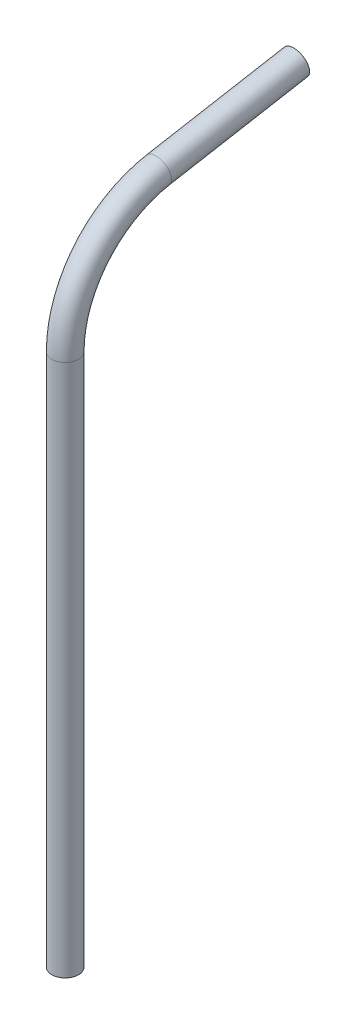
ISO-10303-21;
HEADER;
FILE_DESCRIPTION(('STEP AP214'),'2;1');
FILE_NAME('part.step','',(''),(''),'','','');
FILE_SCHEMA(('AUTOMOTIVE_DESIGN { 1 0 10303 214 1 1 1 1 }'));
ENDSEC;
DATA;
#1=APPLICATION_CONTEXT('core data for automotive mechanical design processes');
#2=APPLICATION_PROTOCOL_DEFINITION('international standard','automotive_design',2000,#1);
#3=PRODUCT_CONTEXT('',#1,'mechanical');
#4=PRODUCT('Part','Part','',(#3));
#5=PRODUCT_RELATED_PRODUCT_CATEGORY('part','',(#4));
#6=PRODUCT_DEFINITION_FORMATION('','',#4);
#7=PRODUCT_DEFINITION_CONTEXT('part definition',#1,'design');
#8=PRODUCT_DEFINITION('design','',#6,#7);
#9=PRODUCT_DEFINITION_SHAPE('','',#8);
#10=(LENGTH_UNIT() NAMED_UNIT(*) SI_UNIT(.MILLI.,.METRE.));
#11=(NAMED_UNIT(*) PLANE_ANGLE_UNIT() SI_UNIT($,.RADIAN.));
#12=(NAMED_UNIT(*) SI_UNIT($,.STERADIAN.) SOLID_ANGLE_UNIT());
#13=UNCERTAINTY_MEASURE_WITH_UNIT(LENGTH_MEASURE(1.E-05),#10,'distance_accuracy_value','');
#14=(GEOMETRIC_REPRESENTATION_CONTEXT(3) GLOBAL_UNCERTAINTY_ASSIGNED_CONTEXT((#13)) GLOBAL_UNIT_ASSIGNED_CONTEXT((#10,
#11,#12)) REPRESENTATION_CONTEXT('',''));
#15=CARTESIAN_POINT('',(0.,0.,0.));
#16=DIRECTION('',(0.,0.,1.));
#17=DIRECTION('',(1.,0.,0.));
#18=AXIS2_PLACEMENT_3D('',#15,#16,#17);
#19=CARTESIAN_POINT('',(0.,0.,0.));
#20=DIRECTION('',(0.,1.,0.));
#21=DIRECTION('',(0.,0.,1.));
#22=AXIS2_PLACEMENT_3D('',#19,#20,#21);
#23=PLANE('',#22);
#24=CARTESIAN_POINT('',(0.,0.,0.));
#25=DIRECTION('',(0.,1.,0.));
#26=DIRECTION('',(0.,0.,1.));
#27=AXIS2_PLACEMENT_3D('',#24,#25,#26);
#28=CIRCLE('',#27,3.175);
#29=CARTESIAN_POINT('',(0.,0.,3.175));
#30=VERTEX_POINT('',#29);
#31=EDGE_CURVE('E41',#30,#30,#28,.T.);
#32=ORIENTED_EDGE('',*,*,#31,.F.);
#33=EDGE_LOOP('',(#32));
#34=FACE_BOUND('',#33,.T.);
#35=CARTESIAN_POINT('',(0.,0.,0.));
#36=DIRECTION('',(0.,1.,0.));
#37=DIRECTION('',(0.,0.,1.));
#38=AXIS2_PLACEMENT_3D('',#35,#36,#37);
#39=CIRCLE('',#38,2.667);
#40=CARTESIAN_POINT('',(0.,0.,2.667));
#41=VERTEX_POINT('',#40);
#42=EDGE_CURVE('E50',#41,#41,#39,.T.);
#43=ORIENTED_EDGE('',*,*,#42,.T.);
#44=EDGE_LOOP('',(#43));
#45=FACE_BOUND('',#44,.T.);
#46=ADVANCED_FACE('F37',(#34,#45),#23,.F.);
#47=CARTESIAN_POINT('',(0.,127.,0.));
#48=DIRECTION('',(0.,-1.,0.));
#49=DIRECTION('',(0.,0.,-1.));
#50=AXIS2_PLACEMENT_3D('',#47,#48,#49);
#51=CYLINDRICAL_SURFACE('',#50,3.175);
#52=CARTESIAN_POINT('',(0.,127.,0.));
#53=DIRECTION('',(0.,1.,0.));
#54=DIRECTION('',(0.,0.,1.));
#55=AXIS2_PLACEMENT_3D('',#52,#53,#54);
#56=CIRCLE('',#55,3.175);
#57=CARTESIAN_POINT('',(0.,127.,3.175));
#58=VERTEX_POINT('',#57);
#59=EDGE_CURVE('E10',#58,#58,#56,.T.);
#60=ORIENTED_EDGE('',*,*,#59,.F.);
#61=EDGE_LOOP('',(#60));
#62=FACE_BOUND('',#61,.T.);
#63=ORIENTED_EDGE('',*,*,#31,.T.);
#64=EDGE_LOOP('',(#63));
#65=FACE_BOUND('',#64,.T.);
#66=ADVANCED_FACE('F39',(#62,#65),#51,.T.);
#67=CARTESIAN_POINT('',(0.,127.,0.));
#68=DIRECTION('',(0.,-1.,0.));
#69=DIRECTION('',(0.,0.,-1.));
#70=AXIS2_PLACEMENT_3D('',#67,#68,#69);
#71=CYLINDRICAL_SURFACE('',#70,2.667);
#72=CARTESIAN_POINT('',(0.,127.,0.));
#73=DIRECTION('',(0.,1.,0.));
#74=DIRECTION('',(0.,0.,1.));
#75=AXIS2_PLACEMENT_3D('',#72,#73,#74);
#76=CIRCLE('',#75,2.667);
#77=CARTESIAN_POINT('',(0.,127.,2.667));
#78=VERTEX_POINT('',#77);
#79=EDGE_CURVE('E64',#78,#78,#76,.F.);
#80=ORIENTED_EDGE('',*,*,#79,.F.);
#81=EDGE_LOOP('',(#80));
#82=FACE_BOUND('',#81,.T.);
#83=ORIENTED_EDGE('',*,*,#42,.F.);
#84=EDGE_LOOP('',(#83));
#85=FACE_BOUND('',#84,.T.);
#86=ADVANCED_FACE('F78',(#82,#85),#71,.F.);
#87=CARTESIAN_POINT('',(0.,127.,-26.8718328635355));
#88=DIRECTION('',(-1.,0.,0.));
#89=DIRECTION('',(0.,0.,1.));
#90=AXIS2_PLACEMENT_3D('',#87,#88,#89);
#91=TOROIDAL_SURFACE('',#90,26.8718328635355,3.175);
#92=CARTESIAN_POINT('',(0.,153.456678788018,-22.1665646508399));
#93=DIRECTION('',(0.,0.175100382493096,-0.984550585826229));
#94=DIRECTION('',(0.,0.984550585826229,0.175100382493096));
#95=AXIS2_PLACEMENT_3D('',#92,#93,#94);
#96=CIRCLE('',#95,3.175);
#97=CARTESIAN_POINT('',(0.,156.582626898017,-21.6106209364243));
#98=VERTEX_POINT('',#97);
#99=EDGE_CURVE('E56',#98,#98,#96,.T.);
#100=CARTESIAN_POINT('',(0.,127.,-26.8718328635355));
#101=DIRECTION('',(-1.,0.,0.));
#102=DIRECTION('',(0.,0.,1.));
#103=AXIS2_PLACEMENT_3D('',#100,#101,#102);
#104=CIRCLE('',#103,30.0468328635355);
#105=EDGE_CURVE('',#58,#98,#104,.T.);
#106=ORIENTED_EDGE('',*,*,#59,.T.);
#107=ORIENTED_EDGE('',*,*,#99,.F.);
#108=ORIENTED_EDGE('',*,*,#105,.T.);
#109=ORIENTED_EDGE('',*,*,#105,.F.);
#110=EDGE_LOOP('',(#106,#108,#107,#109));
#111=FACE_BOUND('',#110,.T.);
#112=ADVANCED_FACE('F81',(#111),#91,.T.);
#113=CARTESIAN_POINT('',(0.,153.456678788018,-22.1665646508399));
#114=DIRECTION('',(0.,0.175100382493096,-0.984550585826229));
#115=DIRECTION('',(0.,0.984550585826229,0.175100382493096));
#116=AXIS2_PLACEMENT_3D('',#113,#114,#115);
#117=CYLINDRICAL_SURFACE('',#116,3.175);
#118=CARTESIAN_POINT('',(0.,159.298316561638,-55.0127972536055));
#119=DIRECTION('',(0.,0.175100382493096,-0.984550585826229));
#120=DIRECTION('',(0.,0.984550585826229,0.175100382493096));
#121=AXIS2_PLACEMENT_3D('',#118,#119,#120);
#122=CIRCLE('',#121,3.175);
#123=CARTESIAN_POINT('',(0.,162.424264671636,-54.4568535391899));
#124=VERTEX_POINT('',#123);
#125=EDGE_CURVE('E60',#124,#124,#122,.T.);
#126=ORIENTED_EDGE('',*,*,#125,.F.);
#127=EDGE_LOOP('',(#126));
#128=FACE_BOUND('',#127,.T.);
#129=ORIENTED_EDGE('',*,*,#99,.T.);
#130=EDGE_LOOP('',(#129));
#131=FACE_BOUND('',#130,.T.);
#132=ADVANCED_FACE('F94',(#128,#131),#117,.T.);
#133=CARTESIAN_POINT('',(0.,159.298316561638,-55.0127972536055));
#134=DIRECTION('',(0.,0.175100382493096,-0.984550585826229));
#135=DIRECTION('',(0.,0.984550585826229,0.175100382493096));
#136=AXIS2_PLACEMENT_3D('',#133,#134,#135);
#137=PLANE('',#136);
#138=CARTESIAN_POINT('',(0.,159.298316561638,-55.0127972536055));
#139=DIRECTION('',(0.,0.175100382493096,-0.984550585826229));
#140=DIRECTION('',(0.,0.984550585826229,0.175100382493096));
#141=AXIS2_PLACEMENT_3D('',#138,#139,#140);
#142=CIRCLE('',#141,2.667);
#143=CARTESIAN_POINT('',(0.,161.924112974036,-54.5458045334964));
#144=VERTEX_POINT('',#143);
#145=EDGE_CURVE('E55',#144,#144,#142,.F.);
#146=ORIENTED_EDGE('',*,*,#145,.T.);
#147=EDGE_LOOP('',(#146));
#148=FACE_BOUND('',#147,.T.);
#149=ORIENTED_EDGE('',*,*,#125,.T.);
#150=EDGE_LOOP('',(#149));
#151=FACE_BOUND('',#150,.T.);
#152=ADVANCED_FACE('F97',(#148,#151),#137,.T.);
#153=CARTESIAN_POINT('',(0.,127.,-26.8718328635355));
#154=DIRECTION('',(-1.,0.,0.));
#155=DIRECTION('',(0.,0.,1.));
#156=AXIS2_PLACEMENT_3D('',#153,#154,#155);
#157=TOROIDAL_SURFACE('',#156,26.8718328635355,2.667);
#158=CARTESIAN_POINT('',(0.,153.456678788018,-22.1665646508399));
#159=DIRECTION('',(0.,0.175100382493096,-0.984550585826229));
#160=DIRECTION('',(0.,0.984550585826229,0.175100382493096));
#161=AXIS2_PLACEMENT_3D('',#158,#159,#160);
#162=CIRCLE('',#161,2.667);
#163=CARTESIAN_POINT('',(0.,156.082475200417,-21.6995719307308));
#164=VERTEX_POINT('',#163);
#165=EDGE_CURVE('E68',#164,#164,#162,.F.);
#166=CARTESIAN_POINT('',(0.,127.,-26.8718328635355));
#167=DIRECTION('',(-1.,0.,0.));
#168=DIRECTION('',(0.,0.,1.));
#169=AXIS2_PLACEMENT_3D('',#166,#167,#168);
#170=CIRCLE('',#169,29.5388328635355);
#171=EDGE_CURVE('',#78,#164,#170,.T.);
#172=ORIENTED_EDGE('',*,*,#79,.T.);
#173=ORIENTED_EDGE('',*,*,#165,.F.);
#174=ORIENTED_EDGE('',*,*,#171,.T.);
#175=ORIENTED_EDGE('',*,*,#171,.F.);
#176=EDGE_LOOP('',(#172,#174,#173,#175));
#177=FACE_BOUND('',#176,.T.);
#178=ADVANCED_FACE('F76',(#177),#157,.F.);
#179=CARTESIAN_POINT('',(0.,153.456678788018,-22.1665646508399));
#180=DIRECTION('',(0.,0.175100382493096,-0.984550585826229));
#181=DIRECTION('',(0.,0.984550585826229,0.175100382493096));
#182=AXIS2_PLACEMENT_3D('',#179,#180,#181);
#183=CYLINDRICAL_SURFACE('',#182,2.667);
#184=ORIENTED_EDGE('',*,*,#145,.F.);
#185=EDGE_LOOP('',(#184));
#186=FACE_BOUND('',#185,.T.);
#187=ORIENTED_EDGE('',*,*,#165,.T.);
#188=EDGE_LOOP('',(#187));
#189=FACE_BOUND('',#188,.T.);
#190=ADVANCED_FACE('F83',(#186,#189),#183,.F.);
#191=CLOSED_SHELL('',(#46,#66,#86,#112,#132,#152,#178,#190));
#192=MANIFOLD_SOLID_BREP('B2',#191);
#193=ADVANCED_BREP_SHAPE_REPRESENTATION('',(#18,#192),#14);
#194=SHAPE_DEFINITION_REPRESENTATION(#9,#193);
ENDSEC;
END-ISO-10303-21;
